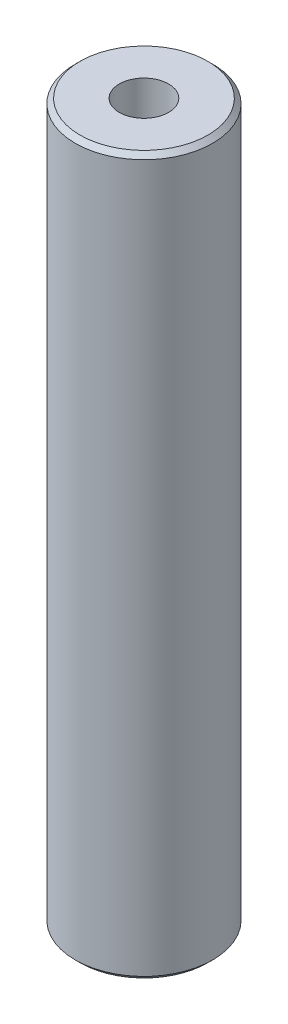
ISO-10303-21;
HEADER;
FILE_DESCRIPTION(('STEP AP214'),'2;1');
FILE_NAME('part.step','',(''),(''),'','','');
FILE_SCHEMA(('AUTOMOTIVE_DESIGN { 1 0 10303 214 1 1 1 1 }'));
ENDSEC;
DATA;
#1=APPLICATION_CONTEXT('core data for automotive mechanical design processes');
#2=APPLICATION_PROTOCOL_DEFINITION('international standard','automotive_design',2000,#1);
#3=PRODUCT_CONTEXT('',#1,'mechanical');
#4=PRODUCT('Part','Part','',(#3));
#5=PRODUCT_RELATED_PRODUCT_CATEGORY('part','',(#4));
#6=PRODUCT_DEFINITION_FORMATION('','',#4);
#7=PRODUCT_DEFINITION_CONTEXT('part definition',#1,'design');
#8=PRODUCT_DEFINITION('design','',#6,#7);
#9=PRODUCT_DEFINITION_SHAPE('','',#8);
#10=(LENGTH_UNIT() NAMED_UNIT(*) SI_UNIT(.MILLI.,.METRE.));
#11=(NAMED_UNIT(*) PLANE_ANGLE_UNIT() SI_UNIT($,.RADIAN.));
#12=(NAMED_UNIT(*) SI_UNIT($,.STERADIAN.) SOLID_ANGLE_UNIT());
#13=UNCERTAINTY_MEASURE_WITH_UNIT(LENGTH_MEASURE(1.E-05),#10,'distance_accuracy_value','');
#14=(GEOMETRIC_REPRESENTATION_CONTEXT(3) GLOBAL_UNCERTAINTY_ASSIGNED_CONTEXT((#13)) GLOBAL_UNIT_ASSIGNED_CONTEXT((#10,
#11,#12)) REPRESENTATION_CONTEXT('',''));
#15=CARTESIAN_POINT('',(0.,0.,0.));
#16=DIRECTION('',(0.,0.,1.));
#17=DIRECTION('',(1.,0.,0.));
#18=AXIS2_PLACEMENT_3D('',#15,#16,#17);
#19=CARTESIAN_POINT('',(0.,600.,0.));
#20=DIRECTION('',(0.,-1.,0.));
#21=DIRECTION('',(0.,0.,-1.));
#22=AXIS2_PLACEMENT_3D('',#19,#20,#21);
#23=CYLINDRICAL_SURFACE('',#22,57.5);
#24=CARTESIAN_POINT('',(0.,596.017865680013,0.));
#25=DIRECTION('',(0.,1.,0.));
#26=DIRECTION('',(0.,0.,1.));
#27=AXIS2_PLACEMENT_3D('',#24,#25,#26);
#28=CIRCLE('',#27,57.5);
#29=CARTESIAN_POINT('',(0.,596.017865680013,57.5));
#30=VERTEX_POINT('',#29);
#31=EDGE_CURVE('E50',#30,#30,#28,.F.);
#32=ORIENTED_EDGE('',*,*,#31,.T.);
#33=EDGE_LOOP('',(#32));
#34=FACE_BOUND('',#33,.T.);
#35=CARTESIAN_POINT('',(0.,3.98213431998684,0.));
#36=DIRECTION('',(0.,1.,0.));
#37=DIRECTION('',(0.,0.,1.));
#38=AXIS2_PLACEMENT_3D('',#35,#36,#37);
#39=CIRCLE('',#38,57.5);
#40=CARTESIAN_POINT('',(0.,3.98213431998684,57.5));
#41=VERTEX_POINT('',#40);
#42=EDGE_CURVE('E51',#41,#41,#39,.T.);
#43=ORIENTED_EDGE('',*,*,#42,.T.);
#44=EDGE_LOOP('',(#43));
#45=FACE_BOUND('',#44,.T.);
#46=ADVANCED_FACE('F39',(#34,#45),#23,.T.);
#47=CARTESIAN_POINT('',(0.,600.,0.));
#48=DIRECTION('',(0.,1.,0.));
#49=DIRECTION('',(0.,0.,1.));
#50=AXIS2_PLACEMENT_3D('',#47,#48,#49);
#51=PLANE('',#50);
#52=CARTESIAN_POINT('',(0.,600.,0.));
#53=DIRECTION('',(0.,1.,0.));
#54=DIRECTION('',(0.,0.,1.));
#55=AXIS2_PLACEMENT_3D('',#52,#53,#54);
#56=CIRCLE('',#55,53.5178656800133);
#57=CARTESIAN_POINT('',(0.,600.,53.5178656800133));
#58=VERTEX_POINT('',#57);
#59=EDGE_CURVE('E54',#58,#58,#56,.T.);
#60=ORIENTED_EDGE('',*,*,#59,.T.);
#61=EDGE_LOOP('',(#60));
#62=FACE_BOUND('',#61,.T.);
#63=CARTESIAN_POINT('',(0.,600.,0.));
#64=DIRECTION('',(0.,1.,0.));
#65=DIRECTION('',(0.,0.,1.));
#66=AXIS2_PLACEMENT_3D('',#63,#64,#65);
#67=CIRCLE('',#66,20.653985287087);
#68=CARTESIAN_POINT('',(0.,600.,20.653985287087));
#69=VERTEX_POINT('',#68);
#70=EDGE_CURVE('E58',#69,#69,#67,.T.);
#71=ORIENTED_EDGE('',*,*,#70,.F.);
#72=EDGE_LOOP('',(#71));
#73=FACE_BOUND('',#72,.T.);
#74=ADVANCED_FACE('F69',(#62,#73),#51,.T.);
#75=CARTESIAN_POINT('',(0.,0.,0.));
#76=DIRECTION('',(0.,1.,0.));
#77=DIRECTION('',(0.,0.,1.));
#78=AXIS2_PLACEMENT_3D('',#75,#76,#77);
#79=PLANE('',#78);
#80=CARTESIAN_POINT('',(0.,0.,0.));
#81=DIRECTION('',(0.,1.,0.));
#82=DIRECTION('',(0.,0.,1.));
#83=AXIS2_PLACEMENT_3D('',#80,#81,#82);
#84=CIRCLE('',#83,53.5178656800131);
#85=CARTESIAN_POINT('',(0.,0.,53.5178656800131));
#86=VERTEX_POINT('',#85);
#87=EDGE_CURVE('E10',#86,#86,#84,.F.);
#88=ORIENTED_EDGE('',*,*,#87,.T.);
#89=EDGE_LOOP('',(#88));
#90=FACE_BOUND('',#89,.T.);
#91=CARTESIAN_POINT('',(0.,0.,0.));
#92=DIRECTION('',(0.,1.,0.));
#93=DIRECTION('',(0.,0.,1.));
#94=AXIS2_PLACEMENT_3D('',#91,#92,#93);
#95=CIRCLE('',#94,20.653985287087);
#96=CARTESIAN_POINT('',(0.,0.,20.653985287087));
#97=VERTEX_POINT('',#96);
#98=EDGE_CURVE('E63',#97,#97,#95,.T.);
#99=ORIENTED_EDGE('',*,*,#98,.T.);
#100=EDGE_LOOP('',(#99));
#101=FACE_BOUND('',#100,.T.);
#102=ADVANCED_FACE('F75',(#90,#101),#79,.F.);
#103=CARTESIAN_POINT('',(0.,600.,0.));
#104=DIRECTION('',(0.,-1.,0.));
#105=DIRECTION('',(0.,0.,-1.));
#106=AXIS2_PLACEMENT_3D('',#103,#104,#105);
#107=CYLINDRICAL_SURFACE('',#106,20.653985287087);
#108=ORIENTED_EDGE('',*,*,#70,.T.);
#109=EDGE_LOOP('',(#108));
#110=FACE_BOUND('',#109,.T.);
#111=ORIENTED_EDGE('',*,*,#98,.F.);
#112=EDGE_LOOP('',(#111));
#113=FACE_BOUND('',#112,.T.);
#114=ADVANCED_FACE('F70',(#110,#113),#107,.F.);
#115=CARTESIAN_POINT('',(0.,600.,0.));
#116=DIRECTION('',(0.,-1.,0.));
#117=DIRECTION('',(0.,0.,-1.));
#118=AXIS2_PLACEMENT_3D('',#115,#116,#117);
#119=CONICAL_SURFACE('',#118,53.5178656800133,0.785398163397428);
#120=ORIENTED_EDGE('',*,*,#31,.F.);
#121=EDGE_LOOP('',(#120));
#122=FACE_BOUND('',#121,.T.);
#123=ORIENTED_EDGE('',*,*,#59,.F.);
#124=EDGE_LOOP('',(#123));
#125=FACE_BOUND('',#124,.T.);
#126=ADVANCED_FACE('F81',(#122,#125),#119,.T.);
#127=CARTESIAN_POINT('',(0.,3.98213431998684,0.));
#128=DIRECTION('',(0.,1.,0.));
#129=DIRECTION('',(0.,0.,1.));
#130=AXIS2_PLACEMENT_3D('',#127,#128,#129);
#131=CONICAL_SURFACE('',#130,57.5,0.785398163397455);
#132=ORIENTED_EDGE('',*,*,#87,.F.);
#133=EDGE_LOOP('',(#132));
#134=FACE_BOUND('',#133,.T.);
#135=ORIENTED_EDGE('',*,*,#42,.F.);
#136=EDGE_LOOP('',(#135));
#137=FACE_BOUND('',#136,.T.);
#138=ADVANCED_FACE('F45',(#134,#137),#131,.T.);
#139=CLOSED_SHELL('',(#46,#74,#102,#114,#126,#138));
#140=MANIFOLD_SOLID_BREP('B2',#139);
#141=ADVANCED_BREP_SHAPE_REPRESENTATION('',(#18,#140),#14);
#142=SHAPE_DEFINITION_REPRESENTATION(#9,#141);
ENDSEC;
END-ISO-10303-21;
